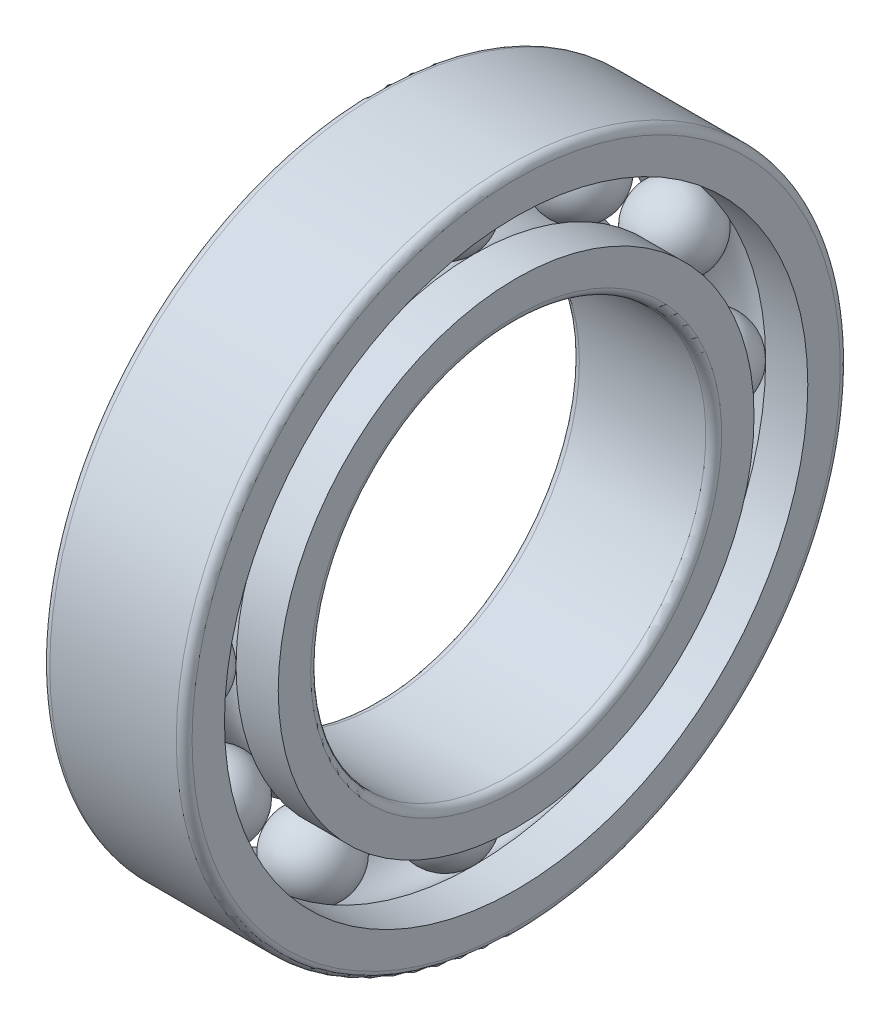
ISO-10303-21;
HEADER;
FILE_DESCRIPTION(('STEP AP214'),'2;1');
FILE_NAME('part.step','',(''),(''),'','','');
FILE_SCHEMA(('AUTOMOTIVE_DESIGN { 1 0 10303 214 1 1 1 1 }'));
ENDSEC;
DATA;
#1=APPLICATION_CONTEXT('core data for automotive mechanical design processes');
#2=APPLICATION_PROTOCOL_DEFINITION('international standard','automotive_design',2000,#1);
#3=PRODUCT_CONTEXT('',#1,'mechanical');
#4=PRODUCT('Part','Part','',(#3));
#5=PRODUCT_RELATED_PRODUCT_CATEGORY('part','',(#4));
#6=PRODUCT_DEFINITION_FORMATION('','',#4);
#7=PRODUCT_DEFINITION_CONTEXT('part definition',#1,'design');
#8=PRODUCT_DEFINITION('design','',#6,#7);
#9=PRODUCT_DEFINITION_SHAPE('','',#8);
#10=(LENGTH_UNIT() NAMED_UNIT(*) SI_UNIT(.MILLI.,.METRE.));
#11=(NAMED_UNIT(*) PLANE_ANGLE_UNIT() SI_UNIT($,.RADIAN.));
#12=(NAMED_UNIT(*) SI_UNIT($,.STERADIAN.) SOLID_ANGLE_UNIT());
#13=UNCERTAINTY_MEASURE_WITH_UNIT(LENGTH_MEASURE(1.E-05),#10,'distance_accuracy_value','');
#14=(GEOMETRIC_REPRESENTATION_CONTEXT(3) GLOBAL_UNCERTAINTY_ASSIGNED_CONTEXT((#13)) GLOBAL_UNIT_ASSIGNED_CONTEXT((#10,
#11,#12)) REPRESENTATION_CONTEXT('',''));
#15=CARTESIAN_POINT('',(0.,0.,0.));
#16=DIRECTION('',(0.,0.,1.));
#17=DIRECTION('',(1.,0.,0.));
#18=AXIS2_PLACEMENT_3D('',#15,#16,#17);
#19=CARTESIAN_POINT('',(4.50000000000001,14.5059255133895,-8.37499999999983));
#20=DIRECTION('',(-1.,0.,0.));
#21=DIRECTION('',(0.,0.866025403784445,-0.499999999999989));
#22=AXIS2_PLACEMENT_3D('',#19,#20,#21);
#23=SPHERICAL_SURFACE('',#22,2.49999999999999);
#24=CARTESIAN_POINT('',(2.00000000000002,14.5059255133895,-8.37499999999983));
#25=VERTEX_POINT('',#24);
#26=VERTEX_LOOP('',#25);
#27=FACE_BOUND('',#26,.T.);
#28=ADVANCED_FACE('F37',(#27),#23,.T.);
#29=CLOSED_SHELL('',(#28));
#30=MANIFOLD_SOLID_BREP('B2',#29);
#31=CARTESIAN_POINT('',(4.50000000000001,8.37500000000018,-14.5059255133893));
#32=DIRECTION('',(-1.,0.,0.));
#33=DIRECTION('',(0.,0.50000000000001,-0.866025403784433));
#34=AXIS2_PLACEMENT_3D('',#31,#32,#33);
#35=SPHERICAL_SURFACE('',#34,2.49999999999999);
#36=CARTESIAN_POINT('',(2.00000000000002,8.37500000000018,-14.5059255133893));
#37=VERTEX_POINT('',#36);
#38=VERTEX_LOOP('',#37);
#39=FACE_BOUND('',#38,.T.);
#40=ADVANCED_FACE('F55',(#39),#35,.T.);
#41=CLOSED_SHELL('',(#40));
#42=MANIFOLD_SOLID_BREP('B6',#41);
#43=CARTESIAN_POINT('',(4.50000000000001,1.75446937276868E-13,-16.75));
#44=DIRECTION('',(-1.,0.,0.));
#45=DIRECTION('',(0.,0.,-1.));
#46=AXIS2_PLACEMENT_3D('',#43,#44,#45);
#47=SPHERICAL_SURFACE('',#46,2.49999999999999);
#48=CARTESIAN_POINT('',(2.00000000000002,1.75446937276868E-13,-16.75));
#49=VERTEX_POINT('',#48);
#50=VERTEX_LOOP('',#49);
#51=FACE_BOUND('',#50,.T.);
#52=ADVANCED_FACE('F73',(#51),#47,.T.);
#53=CLOSED_SHELL('',(#52));
#54=MANIFOLD_SOLID_BREP('B33',#53);
#55=CARTESIAN_POINT('',(4.50000000000001,-8.37499999999988,-14.5059255133894));
#56=DIRECTION('',(-1.,0.,0.));
#57=DIRECTION('',(0.,-0.499999999999992,-0.866025403784443));
#58=AXIS2_PLACEMENT_3D('',#55,#56,#57);
#59=SPHERICAL_SURFACE('',#58,2.49999999999999);
#60=CARTESIAN_POINT('',(2.00000000000002,-8.37499999999988,-14.5059255133894));
#61=VERTEX_POINT('',#60);
#62=VERTEX_LOOP('',#61);
#63=FACE_BOUND('',#62,.T.);
#64=ADVANCED_FACE('F91',(#63),#59,.T.);
#65=CLOSED_SHELL('',(#64));
#66=MANIFOLD_SOLID_BREP('B51',#65);
#67=CARTESIAN_POINT('',(4.50000000000001,-14.5059255133893,-8.37500000000013));
#68=DIRECTION('',(-1.,0.,0.));
#69=DIRECTION('',(0.,-0.866025403784435,-0.500000000000007));
#70=AXIS2_PLACEMENT_3D('',#67,#68,#69);
#71=SPHERICAL_SURFACE('',#70,2.49999999999999);
#72=CARTESIAN_POINT('',(2.00000000000002,-14.5059255133893,-8.37500000000013));
#73=VERTEX_POINT('',#72);
#74=VERTEX_LOOP('',#73);
#75=FACE_BOUND('',#74,.T.);
#76=ADVANCED_FACE('F109',(#75),#71,.T.);
#77=CLOSED_SHELL('',(#76));
#78=MANIFOLD_SOLID_BREP('B69',#77);
#79=CARTESIAN_POINT('',(4.50000000000001,-16.75,0.));
#80=DIRECTION('',(-1.,0.,0.));
#81=DIRECTION('',(0.,-1.,0.));
#82=AXIS2_PLACEMENT_3D('',#79,#80,#81);
#83=SPHERICAL_SURFACE('',#82,2.49999999999999);
#84=CARTESIAN_POINT('',(2.00000000000002,-16.75,0.));
#85=VERTEX_POINT('',#84);
#86=VERTEX_LOOP('',#85);
#87=FACE_BOUND('',#86,.T.);
#88=ADVANCED_FACE('F127',(#87),#83,.T.);
#89=CLOSED_SHELL('',(#88));
#90=MANIFOLD_SOLID_BREP('B87',#89);
#91=CARTESIAN_POINT('',(4.50000000000001,-14.5059255133894,8.37499999999993));
#92=DIRECTION('',(-1.,0.,0.));
#93=DIRECTION('',(0.,-0.866025403784442,0.499999999999995));
#94=AXIS2_PLACEMENT_3D('',#91,#92,#93);
#95=SPHERICAL_SURFACE('',#94,2.49999999999999);
#96=CARTESIAN_POINT('',(2.00000000000002,-14.5059255133894,8.37499999999993));
#97=VERTEX_POINT('',#96);
#98=VERTEX_LOOP('',#97);
#99=FACE_BOUND('',#98,.T.);
#100=ADVANCED_FACE('F145',(#99),#95,.T.);
#101=CLOSED_SHELL('',(#100));
#102=MANIFOLD_SOLID_BREP('B105',#101);
#103=CARTESIAN_POINT('',(4.50000000000001,-8.37500000000008,14.5059255133893));
#104=DIRECTION('',(-1.,0.,0.));
#105=DIRECTION('',(0.,-0.500000000000004,0.866025403784436));
#106=AXIS2_PLACEMENT_3D('',#103,#104,#105);
#107=SPHERICAL_SURFACE('',#106,2.49999999999999);
#108=CARTESIAN_POINT('',(2.00000000000002,-8.37500000000008,14.5059255133893));
#109=VERTEX_POINT('',#108);
#110=VERTEX_LOOP('',#109);
#111=FACE_BOUND('',#110,.T.);
#112=ADVANCED_FACE('F163',(#111),#107,.T.);
#113=CLOSED_SHELL('',(#112));
#114=MANIFOLD_SOLID_BREP('B123',#113);
#115=CARTESIAN_POINT('',(4.50000000000001,0.,16.75));
#116=DIRECTION('',(-1.,0.,0.));
#117=DIRECTION('',(0.,0.,1.));
#118=AXIS2_PLACEMENT_3D('',#115,#116,#117);
#119=SPHERICAL_SURFACE('',#118,2.49999999999999);
#120=CARTESIAN_POINT('',(2.00000000000002,0.,16.75));
#121=VERTEX_POINT('',#120);
#122=VERTEX_LOOP('',#121);
#123=FACE_BOUND('',#122,.T.);
#124=ADVANCED_FACE('F181',(#123),#119,.T.);
#125=CLOSED_SHELL('',(#124));
#126=MANIFOLD_SOLID_BREP('B141',#125);
#127=CARTESIAN_POINT('',(4.50000000000001,8.37499999999998,14.5059255133894));
#128=DIRECTION('',(-1.,0.,0.));
#129=DIRECTION('',(0.,0.499999999999998,0.86602540378444));
#130=AXIS2_PLACEMENT_3D('',#127,#128,#129);
#131=SPHERICAL_SURFACE('',#130,2.49999999999999);
#132=CARTESIAN_POINT('',(2.00000000000002,8.37499999999998,14.5059255133894));
#133=VERTEX_POINT('',#132);
#134=VERTEX_LOOP('',#133);
#135=FACE_BOUND('',#134,.T.);
#136=ADVANCED_FACE('F199',(#135),#131,.T.);
#137=CLOSED_SHELL('',(#136));
#138=MANIFOLD_SOLID_BREP('B159',#137);
#139=CARTESIAN_POINT('',(4.50000000000001,14.5059255133894,8.37500000000003));
#140=DIRECTION('',(-1.,0.,0.));
#141=DIRECTION('',(0.,0.866025403784438,0.500000000000001));
#142=AXIS2_PLACEMENT_3D('',#139,#140,#141);
#143=SPHERICAL_SURFACE('',#142,2.49999999999999);
#144=CARTESIAN_POINT('',(2.00000000000002,14.5059255133894,8.37500000000003));
#145=VERTEX_POINT('',#144);
#146=VERTEX_LOOP('',#145);
#147=FACE_BOUND('',#146,.T.);
#148=ADVANCED_FACE('F217',(#147),#143,.T.);
#149=CLOSED_SHELL('',(#148));
#150=MANIFOLD_SOLID_BREP('B177',#149);
#151=CARTESIAN_POINT('',(4.50000000000001,16.75,0.));
#152=DIRECTION('',(-1.,0.,0.));
#153=DIRECTION('',(0.,1.,0.));
#154=AXIS2_PLACEMENT_3D('',#151,#152,#153);
#155=SPHERICAL_SURFACE('',#154,2.49999999999999);
#156=CARTESIAN_POINT('',(2.00000000000002,16.75,0.));
#157=VERTEX_POINT('',#156);
#158=VERTEX_LOOP('',#157);
#159=FACE_BOUND('',#158,.T.);
#160=ADVANCED_FACE('F237',(#159),#155,.T.);
#161=CLOSED_SHELL('',(#160));
#162=MANIFOLD_SOLID_BREP('B195',#161);
#163=CARTESIAN_POINT('',(0.,0.,0.));
#164=DIRECTION('',(-1.,0.,0.));
#165=DIRECTION('',(0.,0.,1.));
#166=AXIS2_PLACEMENT_3D('',#163,#164,#165);
#167=CYLINDRICAL_SURFACE('',#166,18.45);
#168=CARTESIAN_POINT('',(2.66696972201768,0.,0.));
#169=DIRECTION('',(-1.,0.,0.));
#170=DIRECTION('',(0.,0.,1.));
#171=AXIS2_PLACEMENT_3D('',#168,#169,#170);
#172=CIRCLE('',#171,18.45);
#173=CARTESIAN_POINT('',(2.66696972201768,0.,18.45));
#174=VERTEX_POINT('',#173);
#175=EDGE_CURVE('E285',#174,#174,#172,.T.);
#176=ORIENTED_EDGE('',*,*,#175,.F.);
#177=EDGE_LOOP('',(#176));
#178=FACE_BOUND('',#177,.T.);
#179=CARTESIAN_POINT('',(0.,0.,0.));
#180=DIRECTION('',(-1.,0.,0.));
#181=DIRECTION('',(0.,0.,1.));
#182=AXIS2_PLACEMENT_3D('',#179,#180,#181);
#183=CIRCLE('',#182,18.45);
#184=CARTESIAN_POINT('',(0.,0.,18.45));
#185=VERTEX_POINT('',#184);
#186=EDGE_CURVE('E276',#185,#185,#183,.T.);
#187=ORIENTED_EDGE('',*,*,#186,.T.);
#188=EDGE_LOOP('',(#187));
#189=FACE_BOUND('',#188,.T.);
#190=ADVANCED_FACE('F256',(#178,#189),#167,.F.);
#191=CARTESIAN_POINT('',(0.,21.0000000000008,0.));
#192=DIRECTION('',(1.,0.,0.));
#193=DIRECTION('',(0.,0.,-1.));
#194=AXIS2_PLACEMENT_3D('',#191,#192,#193);
#195=PLANE('',#194);
#196=CARTESIAN_POINT('',(0.,0.,0.));
#197=DIRECTION('',(1.,0.,0.));
#198=DIRECTION('',(0.,0.,-1.));
#199=AXIS2_PLACEMENT_3D('',#196,#197,#198);
#200=CIRCLE('',#199,20.5000000000004);
#201=CARTESIAN_POINT('',(0.,0.,-20.5000000000004));
#202=VERTEX_POINT('',#201);
#203=EDGE_CURVE('E236',#202,#202,#200,.F.);
#204=ORIENTED_EDGE('',*,*,#203,.T.);
#205=EDGE_LOOP('',(#204));
#206=FACE_BOUND('',#205,.T.);
#207=ORIENTED_EDGE('',*,*,#186,.F.);
#208=EDGE_LOOP('',(#207));
#209=FACE_BOUND('',#208,.T.);
#210=ADVANCED_FACE('F294',(#206,#209),#195,.F.);
#211=CARTESIAN_POINT('',(0.,0.,0.));
#212=DIRECTION('',(-1.,0.,0.));
#213=DIRECTION('',(0.,0.,1.));
#214=AXIS2_PLACEMENT_3D('',#211,#212,#213);
#215=CYLINDRICAL_SURFACE('',#214,21.0000000000004);
#216=CARTESIAN_POINT('',(8.5,0.,0.));
#217=DIRECTION('',(-1.,0.,0.));
#218=DIRECTION('',(0.,0.,1.));
#219=AXIS2_PLACEMENT_3D('',#216,#217,#218);
#220=CIRCLE('',#219,21.0000000000004);
#221=CARTESIAN_POINT('',(8.5,0.,21.0000000000004));
#222=VERTEX_POINT('',#221);
#223=EDGE_CURVE('E267',#222,#222,#220,.T.);
#224=ORIENTED_EDGE('',*,*,#223,.T.);
#225=EDGE_LOOP('',(#224));
#226=FACE_BOUND('',#225,.T.);
#227=CARTESIAN_POINT('',(0.5,0.,0.));
#228=DIRECTION('',(1.,0.,0.));
#229=DIRECTION('',(0.,0.,-1.));
#230=AXIS2_PLACEMENT_3D('',#227,#228,#229);
#231=CIRCLE('',#230,21.0000000000004);
#232=CARTESIAN_POINT('',(0.5,0.,-21.0000000000004));
#233=VERTEX_POINT('',#232);
#234=EDGE_CURVE('E271',#233,#233,#231,.T.);
#235=ORIENTED_EDGE('',*,*,#234,.T.);
#236=EDGE_LOOP('',(#235));
#237=FACE_BOUND('',#236,.T.);
#238=ADVANCED_FACE('F299',(#226,#237),#215,.T.);
#239=CARTESIAN_POINT('',(9.,18.45,0.));
#240=DIRECTION('',(-1.,0.,0.));
#241=DIRECTION('',(0.,0.,1.));
#242=AXIS2_PLACEMENT_3D('',#239,#240,#241);
#243=PLANE('',#242);
#244=CARTESIAN_POINT('',(9.,0.,0.));
#245=DIRECTION('',(-1.,0.,0.));
#246=DIRECTION('',(0.,0.,1.));
#247=AXIS2_PLACEMENT_3D('',#244,#245,#246);
#248=CIRCLE('',#247,20.5000000000004);
#249=CARTESIAN_POINT('',(9.,0.,20.5000000000004));
#250=VERTEX_POINT('',#249);
#251=EDGE_CURVE('E263',#250,#250,#248,.F.);
#252=ORIENTED_EDGE('',*,*,#251,.T.);
#253=EDGE_LOOP('',(#252));
#254=FACE_BOUND('',#253,.T.);
#255=CARTESIAN_POINT('',(9.,0.,0.));
#256=DIRECTION('',(-1.,0.,0.));
#257=DIRECTION('',(0.,0.,1.));
#258=AXIS2_PLACEMENT_3D('',#255,#256,#257);
#259=CIRCLE('',#258,18.45);
#260=CARTESIAN_POINT('',(9.,0.,18.45));
#261=VERTEX_POINT('',#260);
#262=EDGE_CURVE('E279',#261,#261,#259,.T.);
#263=ORIENTED_EDGE('',*,*,#262,.T.);
#264=EDGE_LOOP('',(#263));
#265=FACE_BOUND('',#264,.T.);
#266=ADVANCED_FACE('F304',(#254,#265),#243,.F.);
#267=CARTESIAN_POINT('',(0.,0.,0.));
#268=DIRECTION('',(-1.,0.,0.));
#269=DIRECTION('',(0.,0.,1.));
#270=AXIS2_PLACEMENT_3D('',#267,#268,#269);
#271=CYLINDRICAL_SURFACE('',#270,18.45);
#272=ORIENTED_EDGE('',*,*,#262,.F.);
#273=EDGE_LOOP('',(#272));
#274=FACE_BOUND('',#273,.T.);
#275=CARTESIAN_POINT('',(6.33303027798233,0.,0.));
#276=DIRECTION('',(-1.,0.,0.));
#277=DIRECTION('',(0.,0.,1.));
#278=AXIS2_PLACEMENT_3D('',#275,#276,#277);
#279=CIRCLE('',#278,18.45);
#280=CARTESIAN_POINT('',(6.33303027798233,0.,18.45));
#281=VERTEX_POINT('',#280);
#282=EDGE_CURVE('E282',#281,#281,#279,.T.);
#283=ORIENTED_EDGE('',*,*,#282,.T.);
#284=EDGE_LOOP('',(#283));
#285=FACE_BOUND('',#284,.T.);
#286=ADVANCED_FACE('F316',(#274,#285),#271,.F.);
#287=CARTESIAN_POINT('',(4.5,0.,0.));
#288=DIRECTION('',(-1.,0.,0.));
#289=DIRECTION('',(0.,0.,1.));
#290=AXIS2_PLACEMENT_3D('',#287,#288,#289);
#291=TOROIDAL_SURFACE('',#290,16.75,2.50000000000002);
#292=ORIENTED_EDGE('',*,*,#175,.T.);
#293=EDGE_LOOP('',(#292));
#294=FACE_BOUND('',#293,.T.);
#295=ORIENTED_EDGE('',*,*,#282,.F.);
#296=EDGE_LOOP('',(#295));
#297=FACE_BOUND('',#296,.T.);
#298=ADVANCED_FACE('F289',(#294,#297),#291,.F.);
#299=CARTESIAN_POINT('',(8.5,0.,0.));
#300=DIRECTION('',(-1.,0.,0.));
#301=DIRECTION('',(0.,0.,1.));
#302=AXIS2_PLACEMENT_3D('',#299,#300,#301);
#303=TOROIDAL_SURFACE('',#302,20.5000000000004,0.5);
#304=ORIENTED_EDGE('',*,*,#251,.F.);
#305=EDGE_LOOP('',(#304));
#306=FACE_BOUND('',#305,.T.);
#307=ORIENTED_EDGE('',*,*,#223,.F.);
#308=EDGE_LOOP('',(#307));
#309=FACE_BOUND('',#308,.T.);
#310=ADVANCED_FACE('F308',(#306,#309),#303,.T.);
#311=CARTESIAN_POINT('',(0.5,0.,0.));
#312=DIRECTION('',(1.,0.,0.));
#313=DIRECTION('',(0.,0.,-1.));
#314=AXIS2_PLACEMENT_3D('',#311,#312,#313);
#315=TOROIDAL_SURFACE('',#314,20.5000000000004,0.5);
#316=ORIENTED_EDGE('',*,*,#234,.F.);
#317=EDGE_LOOP('',(#316));
#318=FACE_BOUND('',#317,.T.);
#319=ORIENTED_EDGE('',*,*,#203,.F.);
#320=EDGE_LOOP('',(#319));
#321=FACE_BOUND('',#320,.T.);
#322=ADVANCED_FACE('F258',(#318,#321),#315,.T.);
#323=CLOSED_SHELL('',(#190,#210,#238,#266,#286,#298,#310,#322));
#324=MANIFOLD_SOLID_BREP('B213',#323);
#325=CARTESIAN_POINT('',(0.,0.,0.));
#326=DIRECTION('',(-1.,0.,0.));
#327=DIRECTION('',(0.,0.,1.));
#328=AXIS2_PLACEMENT_3D('',#325,#326,#327);
#329=CYLINDRICAL_SURFACE('',#328,15.05);
#330=CARTESIAN_POINT('',(0.,0.,0.));
#331=DIRECTION('',(-1.,0.,0.));
#332=DIRECTION('',(0.,0.,1.));
#333=AXIS2_PLACEMENT_3D('',#330,#331,#332);
#334=CIRCLE('',#333,15.05);
#335=CARTESIAN_POINT('',(0.,0.,15.05));
#336=VERTEX_POINT('',#335);
#337=EDGE_CURVE('E397',#336,#336,#334,.T.);
#338=ORIENTED_EDGE('',*,*,#337,.F.);
#339=EDGE_LOOP('',(#338));
#340=FACE_BOUND('',#339,.T.);
#341=CARTESIAN_POINT('',(2.66696972201767,0.,0.));
#342=DIRECTION('',(-1.,0.,0.));
#343=DIRECTION('',(0.,0.,1.));
#344=AXIS2_PLACEMENT_3D('',#341,#342,#343);
#345=CIRCLE('',#344,15.0500000000001);
#346=CARTESIAN_POINT('',(2.66696972201767,0.,15.0500000000001));
#347=VERTEX_POINT('',#346);
#348=EDGE_CURVE('E406',#347,#347,#345,.T.);
#349=ORIENTED_EDGE('',*,*,#348,.T.);
#350=EDGE_LOOP('',(#349));
#351=FACE_BOUND('',#350,.T.);
#352=ADVANCED_FACE('F377',(#340,#351),#329,.T.);
#353=CARTESIAN_POINT('',(0.,15.05,0.));
#354=DIRECTION('',(1.,0.,0.));
#355=DIRECTION('',(0.,0.,-1.));
#356=AXIS2_PLACEMENT_3D('',#353,#354,#355);
#357=PLANE('',#356);
#358=CARTESIAN_POINT('',(0.,0.,0.));
#359=DIRECTION('',(1.,0.,0.));
#360=DIRECTION('',(0.,0.,-1.));
#361=AXIS2_PLACEMENT_3D('',#358,#359,#360);
#362=CIRCLE('',#361,13.);
#363=CARTESIAN_POINT('',(0.,0.,-13.));
#364=VERTEX_POINT('',#363);
#365=EDGE_CURVE('E255',#364,#364,#362,.T.);
#366=ORIENTED_EDGE('',*,*,#365,.T.);
#367=EDGE_LOOP('',(#366));
#368=FACE_BOUND('',#367,.T.);
#369=ORIENTED_EDGE('',*,*,#337,.T.);
#370=EDGE_LOOP('',(#369));
#371=FACE_BOUND('',#370,.T.);
#372=ADVANCED_FACE('F426',(#368,#371),#357,.F.);
#373=CARTESIAN_POINT('',(0.,0.,0.));
#374=DIRECTION('',(-1.,0.,0.));
#375=DIRECTION('',(0.,0.,1.));
#376=AXIS2_PLACEMENT_3D('',#373,#374,#375);
#377=CYLINDRICAL_SURFACE('',#376,12.5);
#378=CARTESIAN_POINT('',(8.5,0.,0.));
#379=DIRECTION('',(-1.,0.,0.));
#380=DIRECTION('',(0.,0.,1.));
#381=AXIS2_PLACEMENT_3D('',#378,#379,#380);
#382=CIRCLE('',#381,12.5);
#383=CARTESIAN_POINT('',(8.5,0.,12.5));
#384=VERTEX_POINT('',#383);
#385=EDGE_CURVE('E384',#384,#384,#382,.F.);
#386=ORIENTED_EDGE('',*,*,#385,.T.);
#387=EDGE_LOOP('',(#386));
#388=FACE_BOUND('',#387,.T.);
#389=CARTESIAN_POINT('',(0.5,0.,0.));
#390=DIRECTION('',(1.,0.,0.));
#391=DIRECTION('',(0.,0.,-1.));
#392=AXIS2_PLACEMENT_3D('',#389,#390,#391);
#393=CIRCLE('',#392,12.5);
#394=CARTESIAN_POINT('',(0.5,0.,-12.5));
#395=VERTEX_POINT('',#394);
#396=EDGE_CURVE('E388',#395,#395,#393,.F.);
#397=ORIENTED_EDGE('',*,*,#396,.T.);
#398=EDGE_LOOP('',(#397));
#399=FACE_BOUND('',#398,.T.);
#400=ADVANCED_FACE('F432',(#388,#399),#377,.F.);
#401=CARTESIAN_POINT('',(9.,12.5000000000001,0.));
#402=DIRECTION('',(-1.,0.,0.));
#403=DIRECTION('',(0.,0.,1.));
#404=AXIS2_PLACEMENT_3D('',#401,#402,#403);
#405=PLANE('',#404);
#406=CARTESIAN_POINT('',(9.,0.,0.));
#407=DIRECTION('',(-1.,0.,0.));
#408=DIRECTION('',(0.,0.,1.));
#409=AXIS2_PLACEMENT_3D('',#406,#407,#408);
#410=CIRCLE('',#409,13.);
#411=CARTESIAN_POINT('',(9.,0.,13.));
#412=VERTEX_POINT('',#411);
#413=EDGE_CURVE('E392',#412,#412,#410,.T.);
#414=ORIENTED_EDGE('',*,*,#413,.T.);
#415=EDGE_LOOP('',(#414));
#416=FACE_BOUND('',#415,.T.);
#417=CARTESIAN_POINT('',(9.,0.,0.));
#418=DIRECTION('',(-1.,0.,0.));
#419=DIRECTION('',(0.,0.,1.));
#420=AXIS2_PLACEMENT_3D('',#417,#418,#419);
#421=CIRCLE('',#420,15.0500000000001);
#422=CARTESIAN_POINT('',(9.,0.,15.0500000000001));
#423=VERTEX_POINT('',#422);
#424=EDGE_CURVE('E400',#423,#423,#421,.T.);
#425=ORIENTED_EDGE('',*,*,#424,.F.);
#426=EDGE_LOOP('',(#425));
#427=FACE_BOUND('',#426,.T.);
#428=ADVANCED_FACE('F422',(#416,#427),#405,.F.);
#429=CARTESIAN_POINT('',(0.,0.,0.));
#430=DIRECTION('',(-1.,0.,0.));
#431=DIRECTION('',(0.,0.,1.));
#432=AXIS2_PLACEMENT_3D('',#429,#430,#431);
#433=CYLINDRICAL_SURFACE('',#432,15.0500000000001);
#434=CARTESIAN_POINT('',(6.33303027798233,0.,0.));
#435=DIRECTION('',(-1.,0.,0.));
#436=DIRECTION('',(0.,0.,1.));
#437=AXIS2_PLACEMENT_3D('',#434,#435,#436);
#438=CIRCLE('',#437,15.0500000000001);
#439=CARTESIAN_POINT('',(6.33303027798233,0.,15.0500000000001));
#440=VERTEX_POINT('',#439);
#441=EDGE_CURVE('E403',#440,#440,#438,.T.);
#442=ORIENTED_EDGE('',*,*,#441,.F.);
#443=EDGE_LOOP('',(#442));
#444=FACE_BOUND('',#443,.T.);
#445=ORIENTED_EDGE('',*,*,#424,.T.);
#446=EDGE_LOOP('',(#445));
#447=FACE_BOUND('',#446,.T.);
#448=ADVANCED_FACE('F414',(#444,#447),#433,.T.);
#449=CARTESIAN_POINT('',(4.5,0.,0.));
#450=DIRECTION('',(-1.,0.,0.));
#451=DIRECTION('',(0.,0.,1.));
#452=AXIS2_PLACEMENT_3D('',#449,#450,#451);
#453=TOROIDAL_SURFACE('',#452,16.75,2.49999999999996);
#454=ORIENTED_EDGE('',*,*,#441,.T.);
#455=EDGE_LOOP('',(#454));
#456=FACE_BOUND('',#455,.T.);
#457=ORIENTED_EDGE('',*,*,#348,.F.);
#458=EDGE_LOOP('',(#457));
#459=FACE_BOUND('',#458,.T.);
#460=ADVANCED_FACE('F411',(#456,#459),#453,.F.);
#461=CARTESIAN_POINT('',(8.5,0.,0.));
#462=DIRECTION('',(-1.,0.,0.));
#463=DIRECTION('',(0.,0.,1.));
#464=AXIS2_PLACEMENT_3D('',#461,#462,#463);
#465=TOROIDAL_SURFACE('',#464,13.,0.5);
#466=ORIENTED_EDGE('',*,*,#385,.F.);
#467=EDGE_LOOP('',(#466));
#468=FACE_BOUND('',#467,.T.);
#469=ORIENTED_EDGE('',*,*,#413,.F.);
#470=EDGE_LOOP('',(#469));
#471=FACE_BOUND('',#470,.T.);
#472=ADVANCED_FACE('F413',(#468,#471),#465,.T.);
#473=CARTESIAN_POINT('',(0.5,0.,0.));
#474=DIRECTION('',(1.,0.,0.));
#475=DIRECTION('',(0.,0.,-1.));
#476=AXIS2_PLACEMENT_3D('',#473,#474,#475);
#477=TOROIDAL_SURFACE('',#476,13.,0.5);
#478=ORIENTED_EDGE('',*,*,#365,.F.);
#479=EDGE_LOOP('',(#478));
#480=FACE_BOUND('',#479,.T.);
#481=ORIENTED_EDGE('',*,*,#396,.F.);
#482=EDGE_LOOP('',(#481));
#483=FACE_BOUND('',#482,.T.);
#484=ADVANCED_FACE('F379',(#480,#483),#477,.T.);
#485=CLOSED_SHELL('',(#352,#372,#400,#428,#448,#460,#472,#484));
#486=MANIFOLD_SOLID_BREP('B231',#485);
#487=ADVANCED_BREP_SHAPE_REPRESENTATION('',(#18,#30,#42,#54,#66,#78,#90,#102,#114,#126,#138,
#150,#162,#324,#486),#14);
#488=SHAPE_DEFINITION_REPRESENTATION(#9,#487);
ENDSEC;
END-ISO-10303-21;
